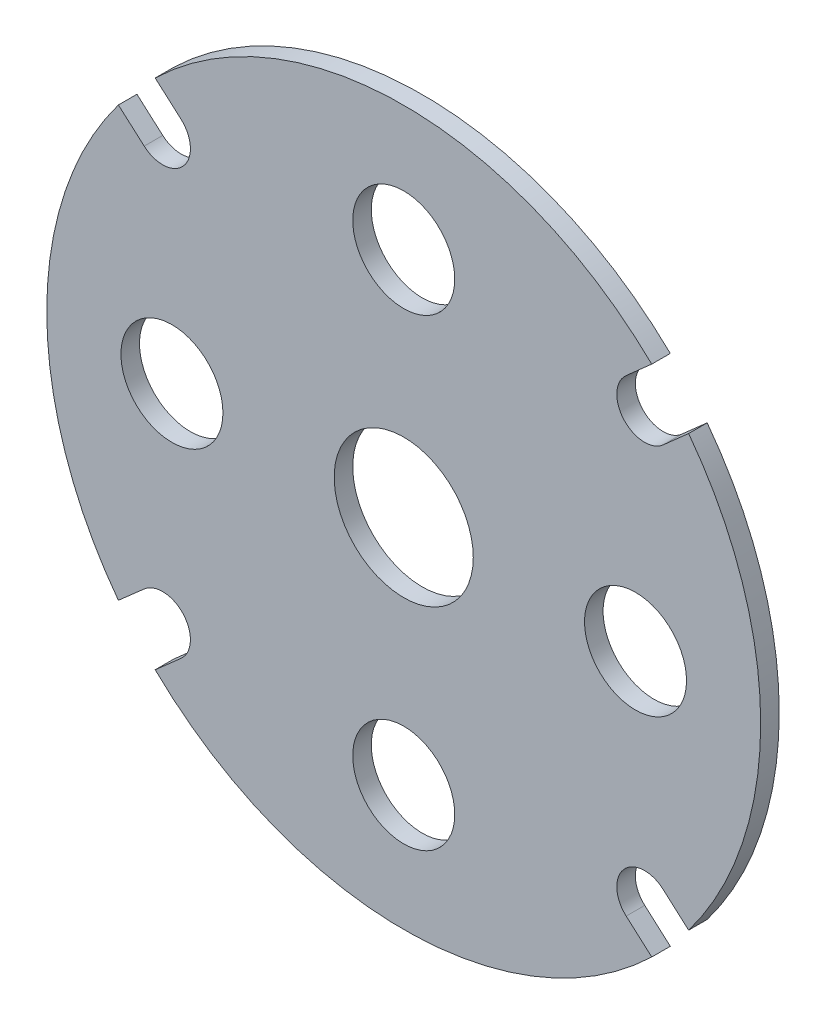
ISO-10303-21;
HEADER;
FILE_DESCRIPTION(('STEP AP214'),'2;1');
FILE_NAME('part.step','',(''),(''),'','','');
FILE_SCHEMA(('AUTOMOTIVE_DESIGN { 1 0 10303 214 1 1 1 1 }'));
ENDSEC;
DATA;
#1=APPLICATION_CONTEXT('core data for automotive mechanical design processes');
#2=APPLICATION_PROTOCOL_DEFINITION('international standard','automotive_design',2000,#1);
#3=PRODUCT_CONTEXT('',#1,'mechanical');
#4=PRODUCT('Part','Part','',(#3));
#5=PRODUCT_RELATED_PRODUCT_CATEGORY('part','',(#4));
#6=PRODUCT_DEFINITION_FORMATION('','',#4);
#7=PRODUCT_DEFINITION_CONTEXT('part definition',#1,'design');
#8=PRODUCT_DEFINITION('design','',#6,#7);
#9=PRODUCT_DEFINITION_SHAPE('','',#8);
#10=(LENGTH_UNIT() NAMED_UNIT(*) SI_UNIT(.MILLI.,.METRE.));
#11=(NAMED_UNIT(*) PLANE_ANGLE_UNIT() SI_UNIT($,.RADIAN.));
#12=(NAMED_UNIT(*) SI_UNIT($,.STERADIAN.) SOLID_ANGLE_UNIT());
#13=UNCERTAINTY_MEASURE_WITH_UNIT(LENGTH_MEASURE(1.E-05),#10,'distance_accuracy_value','');
#14=(GEOMETRIC_REPRESENTATION_CONTEXT(3) GLOBAL_UNCERTAINTY_ASSIGNED_CONTEXT((#13)) GLOBAL_UNIT_ASSIGNED_CONTEXT((#10,
#11,#12)) REPRESENTATION_CONTEXT('',''));
#15=CARTESIAN_POINT('',(0.,0.,0.));
#16=DIRECTION('',(0.,0.,1.));
#17=DIRECTION('',(1.,0.,0.));
#18=AXIS2_PLACEMENT_3D('',#15,#16,#17);
#19=CARTESIAN_POINT('',(0.,0.,2.));
#20=DIRECTION('',(0.,0.,1.));
#21=DIRECTION('',(1.,0.,0.));
#22=AXIS2_PLACEMENT_3D('',#19,#20,#21);
#23=PLANE('',#22);
#24=CARTESIAN_POINT('',(0.,-25.0000000000001,2.));
#25=DIRECTION('',(0.,0.,1.));
#26=DIRECTION('',(1.,0.,0.));
#27=AXIS2_PLACEMENT_3D('',#24,#25,#26);
#28=CIRCLE('',#27,5.50000000000006);
#29=CARTESIAN_POINT('',(5.50000000000006,-25.0000000000001,2.));
#30=VERTEX_POINT('',#29);
#31=EDGE_CURVE('E349',#30,#30,#28,.T.);
#32=ORIENTED_EDGE('',*,*,#31,.F.);
#33=EDGE_LOOP('',(#32));
#34=FACE_BOUND('',#33,.T.);
#35=CARTESIAN_POINT('',(-24.9999999999999,0.,2.));
#36=DIRECTION('',(0.,0.,1.));
#37=DIRECTION('',(1.,0.,0.));
#38=AXIS2_PLACEMENT_3D('',#35,#36,#37);
#39=CIRCLE('',#38,5.50000000000006);
#40=CARTESIAN_POINT('',(-19.4999999999999,0.,2.));
#41=VERTEX_POINT('',#40);
#42=EDGE_CURVE('E361',#41,#41,#39,.T.);
#43=ORIENTED_EDGE('',*,*,#42,.F.);
#44=EDGE_LOOP('',(#43));
#45=FACE_BOUND('',#44,.T.);
#46=CARTESIAN_POINT('',(0.,0.,2.));
#47=DIRECTION('',(0.,0.,1.));
#48=DIRECTION('',(1.,0.,0.));
#49=AXIS2_PLACEMENT_3D('',#46,#47,#48);
#50=CIRCLE('',#49,38.5000000000004);
#51=CARTESIAN_POINT('',(-26.8052389537677,-27.63565024803,2.));
#52=VERTEX_POINT('',#51);
#53=CARTESIAN_POINT('',(26.7507981884074,-27.6883512741934,2.));
#54=VERTEX_POINT('',#53);
#55=EDGE_CURVE('E210',#52,#54,#50,.T.);
#56=ORIENTED_EDGE('',*,*,#55,.T.);
#57=DIRECTION('',(-0.748753116344688,0.66284898035987,0.));
#58=VECTOR('',#57,1.);
#59=CARTESIAN_POINT('',(26.7507981884074,-27.6883512741934,2.));
#60=LINE('',#59,#58);
#61=CARTESIAN_POINT('',(23.9922151724542,-25.2462593490348,2.));
#62=VERTEX_POINT('',#61);
#63=EDGE_CURVE('E118',#54,#62,#60,.T.);
#64=ORIENTED_EDGE('',*,*,#63,.T.);
#65=CARTESIAN_POINT('',(25.9807621135339,-23.0000000000006,2.));
#66=DIRECTION('',(0.,0.,-1.));
#67=DIRECTION('',(1.,0.,0.));
#68=AXIS2_PLACEMENT_3D('',#65,#66,#67);
#69=CIRCLE('',#68,3.00000000000024);
#70=CARTESIAN_POINT('',(27.9693090546137,-20.7537406509663,2.));
#71=VERTEX_POINT('',#70);
#72=EDGE_CURVE('E249',#62,#71,#69,.T.);
#73=ORIENTED_EDGE('',*,*,#72,.T.);
#74=DIRECTION('',(0.74875311634469,-0.662848980359867,0.));
#75=VECTOR('',#74,1.);
#76=CARTESIAN_POINT('',(30.727892070567,-23.1958325761249,2.));
#77=LINE('',#76,#75);
#78=CARTESIAN_POINT('',(30.7278920705669,-23.1958325761249,2.));
#79=VERTEX_POINT('',#78);
#80=EDGE_CURVE('E268',#71,#79,#77,.T.);
#81=ORIENTED_EDGE('',*,*,#80,.T.);
#82=CARTESIAN_POINT('',(0.,0.,2.));
#83=DIRECTION('',(0.,0.,1.));
#84=DIRECTION('',(1.,0.,0.));
#85=AXIS2_PLACEMENT_3D('',#82,#83,#84);
#86=CIRCLE('',#85,38.5000000000004);
#87=CARTESIAN_POINT('',(30.727892070567,23.1958325761249,2.));
#88=VERTEX_POINT('',#87);
#89=EDGE_CURVE('E265',#79,#88,#86,.T.);
#90=ORIENTED_EDGE('',*,*,#89,.T.);
#91=DIRECTION('',(-0.74875311634469,-0.662848980359867,0.));
#92=VECTOR('',#91,1.);
#93=CARTESIAN_POINT('',(30.727892070567,23.1958325761249,2.));
#94=LINE('',#93,#92);
#95=CARTESIAN_POINT('',(27.9693090546136,20.7537406509665,2.));
#96=VERTEX_POINT('',#95);
#97=EDGE_CURVE('E267',#88,#96,#94,.T.);
#98=ORIENTED_EDGE('',*,*,#97,.T.);
#99=CARTESIAN_POINT('',(25.9807621135333,23.0000000000004,2.));
#100=DIRECTION('',(0.,0.,-1.));
#101=DIRECTION('',(1.,0.,0.));
#102=AXIS2_PLACEMENT_3D('',#99,#100,#101);
#103=CIRCLE('',#102,3.00000000000033);
#104=CARTESIAN_POINT('',(23.9922151724539,25.2462593490348,2.));
#105=VERTEX_POINT('',#104);
#106=EDGE_CURVE('E270',#96,#105,#103,.T.);
#107=ORIENTED_EDGE('',*,*,#106,.T.);
#108=DIRECTION('',(0.748753116344744,0.662848980359806,0.));
#109=VECTOR('',#108,1.);
#110=CARTESIAN_POINT('',(26.7507981884072,27.688351274193,2.));
#111=LINE('',#110,#109);
#112=CARTESIAN_POINT('',(26.7507981884073,27.6883512741932,2.));
#113=VERTEX_POINT('',#112);
#114=EDGE_CURVE('E276',#105,#113,#111,.T.);
#115=ORIENTED_EDGE('',*,*,#114,.T.);
#116=CARTESIAN_POINT('',(0.,0.,2.));
#117=DIRECTION('',(0.,0.,1.));
#118=DIRECTION('',(1.,0.,0.));
#119=AXIS2_PLACEMENT_3D('',#116,#117,#118);
#120=CIRCLE('',#119,38.5000000000001);
#121=CARTESIAN_POINT('',(-26.8052389537677,27.63565024803,2.));
#122=VERTEX_POINT('',#121);
#123=EDGE_CURVE('E278',#113,#122,#120,.T.);
#124=ORIENTED_EDGE('',*,*,#123,.T.);
#125=DIRECTION('',(0.750056198478579,-0.661374099223626,0.));
#126=VECTOR('',#125,1.);
#127=CARTESIAN_POINT('',(-26.8052389537677,27.63565024803,2.));
#128=LINE('',#127,#126);
#129=CARTESIAN_POINT('',(-24.0224474767815,25.1818791704066,2.));
#130=VERTEX_POINT('',#129);
#131=EDGE_CURVE('E280',#122,#130,#128,.T.);
#132=ORIENTED_EDGE('',*,*,#131,.T.);
#133=CARTESIAN_POINT('',(-26.0065697744526,22.9317105749707,2.));
#134=DIRECTION('',(0.,0.,-1.));
#135=DIRECTION('',(1.,0.,0.));
#136=AXIS2_PLACEMENT_3D('',#133,#134,#135);
#137=CIRCLE('',#136,3.00000000000024);
#138=CARTESIAN_POINT('',(-27.9906920721234,20.6815419795346,2.));
#139=VERTEX_POINT('',#138);
#140=EDGE_CURVE('E282',#130,#139,#137,.T.);
#141=ORIENTED_EDGE('',*,*,#140,.T.);
#142=DIRECTION('',(-0.75005619847863,0.661374099223568,0.));
#143=VECTOR('',#142,1.);
#144=CARTESIAN_POINT('',(-30.7734835491098,23.1353130571578,2.));
#145=LINE('',#144,#143);
#146=CARTESIAN_POINT('',(-30.7734835491098,23.1353130571578,2.));
#147=VERTEX_POINT('',#146);
#148=EDGE_CURVE('E284',#139,#147,#145,.T.);
#149=ORIENTED_EDGE('',*,*,#148,.T.);
#150=CARTESIAN_POINT('',(0.,0.,2.));
#151=DIRECTION('',(0.,0.,1.));
#152=DIRECTION('',(1.,0.,0.));
#153=AXIS2_PLACEMENT_3D('',#150,#151,#152);
#154=CIRCLE('',#153,38.5000000000004);
#155=CARTESIAN_POINT('',(-30.7734835491098,-23.1353130571578,2.));
#156=VERTEX_POINT('',#155);
#157=EDGE_CURVE('E161',#147,#156,#154,.T.);
#158=ORIENTED_EDGE('',*,*,#157,.T.);
#159=DIRECTION('',(0.75005619847863,0.661374099223568,0.));
#160=VECTOR('',#159,1.);
#161=CARTESIAN_POINT('',(-30.7734835491098,-23.1353130571578,2.));
#162=LINE('',#161,#160);
#163=CARTESIAN_POINT('',(-27.9906920721234,-20.6815419795346,2.));
#164=VERTEX_POINT('',#163);
#165=EDGE_CURVE('E155',#156,#164,#162,.T.);
#166=ORIENTED_EDGE('',*,*,#165,.T.);
#167=CARTESIAN_POINT('',(-26.0065697744526,-22.9317105749707,2.));
#168=DIRECTION('',(0.,0.,-1.));
#169=DIRECTION('',(1.,0.,0.));
#170=AXIS2_PLACEMENT_3D('',#167,#168,#169);
#171=CIRCLE('',#170,3.00000000000024);
#172=CARTESIAN_POINT('',(-24.0224474767815,-25.1818791704066,2.));
#173=VERTEX_POINT('',#172);
#174=EDGE_CURVE('E159',#164,#173,#171,.T.);
#175=ORIENTED_EDGE('',*,*,#174,.T.);
#176=DIRECTION('',(-0.750056198478579,-0.661374099223626,0.));
#177=VECTOR('',#176,1.);
#178=CARTESIAN_POINT('',(-26.8052389537677,-27.63565024803,2.));
#179=LINE('',#178,#177);
#180=EDGE_CURVE('E51',#173,#52,#179,.T.);
#181=ORIENTED_EDGE('',*,*,#180,.T.);
#182=EDGE_LOOP('',(#56,#64,#73,#81,#90,#98,#107,#115,#124,#132,#141,#149,#158,#166,#175,#181));
#183=FACE_BOUND('',#182,.T.);
#184=CARTESIAN_POINT('',(0.,0.,2.));
#185=DIRECTION('',(0.,0.,1.));
#186=DIRECTION('',(1.,0.,0.));
#187=AXIS2_PLACEMENT_3D('',#184,#185,#186);
#188=CIRCLE('',#187,7.49999999999984);
#189=CARTESIAN_POINT('',(7.49999999999984,0.,2.));
#190=VERTEX_POINT('',#189);
#191=EDGE_CURVE('E183',#190,#190,#188,.T.);
#192=ORIENTED_EDGE('',*,*,#191,.F.);
#193=EDGE_LOOP('',(#192));
#194=FACE_BOUND('',#193,.T.);
#195=CARTESIAN_POINT('',(0.,24.9999999999999,2.));
#196=DIRECTION('',(0.,0.,1.));
#197=DIRECTION('',(1.,0.,0.));
#198=AXIS2_PLACEMENT_3D('',#195,#196,#197);
#199=CIRCLE('',#198,5.50000000000006);
#200=CARTESIAN_POINT('',(5.50000000000006,24.9999999999999,2.));
#201=VERTEX_POINT('',#200);
#202=EDGE_CURVE('E355',#201,#201,#199,.T.);
#203=ORIENTED_EDGE('',*,*,#202,.F.);
#204=EDGE_LOOP('',(#203));
#205=FACE_BOUND('',#204,.T.);
#206=CARTESIAN_POINT('',(24.9999999999999,0.,2.));
#207=DIRECTION('',(0.,0.,1.));
#208=DIRECTION('',(1.,0.,0.));
#209=AXIS2_PLACEMENT_3D('',#206,#207,#208);
#210=CIRCLE('',#209,5.50000000000006);
#211=CARTESIAN_POINT('',(30.5,0.,2.));
#212=VERTEX_POINT('',#211);
#213=EDGE_CURVE('E340',#212,#212,#210,.T.);
#214=ORIENTED_EDGE('',*,*,#213,.F.);
#215=EDGE_LOOP('',(#214));
#216=FACE_BOUND('',#215,.T.);
#217=ADVANCED_FACE('F34',(#34,#45,#183,#194,#205,#216),#23,.T.);
#218=CARTESIAN_POINT('',(0.,0.,0.));
#219=DIRECTION('',(0.,0.,1.));
#220=DIRECTION('',(1.,0.,0.));
#221=AXIS2_PLACEMENT_3D('',#218,#219,#220);
#222=PLANE('',#221);
#223=CARTESIAN_POINT('',(0.,-25.0000000000001,0.));
#224=DIRECTION('',(0.,0.,1.));
#225=DIRECTION('',(1.,0.,0.));
#226=AXIS2_PLACEMENT_3D('',#223,#224,#225);
#227=CIRCLE('',#226,5.50000000000006);
#228=CARTESIAN_POINT('',(5.50000000000006,-25.0000000000001,0.));
#229=VERTEX_POINT('',#228);
#230=EDGE_CURVE('E346',#229,#229,#227,.T.);
#231=ORIENTED_EDGE('',*,*,#230,.T.);
#232=EDGE_LOOP('',(#231));
#233=FACE_BOUND('',#232,.T.);
#234=CARTESIAN_POINT('',(-24.9999999999999,0.,0.));
#235=DIRECTION('',(0.,0.,1.));
#236=DIRECTION('',(1.,0.,0.));
#237=AXIS2_PLACEMENT_3D('',#234,#235,#236);
#238=CIRCLE('',#237,5.50000000000006);
#239=CARTESIAN_POINT('',(-19.4999999999999,0.,0.));
#240=VERTEX_POINT('',#239);
#241=EDGE_CURVE('E358',#240,#240,#238,.T.);
#242=ORIENTED_EDGE('',*,*,#241,.T.);
#243=EDGE_LOOP('',(#242));
#244=FACE_BOUND('',#243,.T.);
#245=CARTESIAN_POINT('',(0.,0.,0.));
#246=DIRECTION('',(0.,0.,1.));
#247=DIRECTION('',(1.,0.,0.));
#248=AXIS2_PLACEMENT_3D('',#245,#246,#247);
#249=CIRCLE('',#248,38.5000000000004);
#250=CARTESIAN_POINT('',(-26.8052389537677,-27.63565024803,0.));
#251=VERTEX_POINT('',#250);
#252=CARTESIAN_POINT('',(26.7507981884074,-27.6883512741934,0.));
#253=VERTEX_POINT('',#252);
#254=EDGE_CURVE('E179',#251,#253,#249,.T.);
#255=ORIENTED_EDGE('',*,*,#254,.F.);
#256=DIRECTION('',(-0.750056198478579,-0.661374099223626,0.));
#257=VECTOR('',#256,1.);
#258=CARTESIAN_POINT('',(-26.8052389537677,-27.63565024803,0.));
#259=LINE('',#258,#257);
#260=CARTESIAN_POINT('',(-24.0224474767815,-25.1818791704066,0.));
#261=VERTEX_POINT('',#260);
#262=EDGE_CURVE('E110',#261,#251,#259,.T.);
#263=ORIENTED_EDGE('',*,*,#262,.F.);
#264=CARTESIAN_POINT('',(-26.0065697744526,-22.9317105749707,0.));
#265=DIRECTION('',(0.,0.,-1.));
#266=DIRECTION('',(1.,0.,0.));
#267=AXIS2_PLACEMENT_3D('',#264,#265,#266);
#268=CIRCLE('',#267,3.00000000000024);
#269=CARTESIAN_POINT('',(-27.9906920721234,-20.6815419795346,0.));
#270=VERTEX_POINT('',#269);
#271=EDGE_CURVE('E104',#270,#261,#268,.T.);
#272=ORIENTED_EDGE('',*,*,#271,.F.);
#273=DIRECTION('',(0.75005619847863,0.661374099223568,0.));
#274=VECTOR('',#273,1.);
#275=CARTESIAN_POINT('',(-30.7734835491098,-23.1353130571578,0.));
#276=LINE('',#275,#274);
#277=CARTESIAN_POINT('',(-30.7734835491098,-23.1353130571578,0.));
#278=VERTEX_POINT('',#277);
#279=EDGE_CURVE('E169',#278,#270,#276,.T.);
#280=ORIENTED_EDGE('',*,*,#279,.F.);
#281=CARTESIAN_POINT('',(0.,0.,0.));
#282=DIRECTION('',(0.,0.,1.));
#283=DIRECTION('',(1.,0.,0.));
#284=AXIS2_PLACEMENT_3D('',#281,#282,#283);
#285=CIRCLE('',#284,38.5000000000004);
#286=CARTESIAN_POINT('',(-30.7734835491098,23.1353130571578,0.));
#287=VERTEX_POINT('',#286);
#288=EDGE_CURVE('E205',#287,#278,#285,.T.);
#289=ORIENTED_EDGE('',*,*,#288,.F.);
#290=DIRECTION('',(-0.75005619847863,0.661374099223568,0.));
#291=VECTOR('',#290,1.);
#292=CARTESIAN_POINT('',(-30.7734835491098,23.1353130571578,0.));
#293=LINE('',#292,#291);
#294=CARTESIAN_POINT('',(-27.9906920721234,20.6815419795346,0.));
#295=VERTEX_POINT('',#294);
#296=EDGE_CURVE('E203',#295,#287,#293,.T.);
#297=ORIENTED_EDGE('',*,*,#296,.F.);
#298=CARTESIAN_POINT('',(-26.0065697744526,22.9317105749707,0.));
#299=DIRECTION('',(0.,0.,-1.));
#300=DIRECTION('',(1.,0.,0.));
#301=AXIS2_PLACEMENT_3D('',#298,#299,#300);
#302=CIRCLE('',#301,3.00000000000024);
#303=CARTESIAN_POINT('',(-24.0224474767815,25.1818791704066,0.));
#304=VERTEX_POINT('',#303);
#305=EDGE_CURVE('E201',#304,#295,#302,.T.);
#306=ORIENTED_EDGE('',*,*,#305,.F.);
#307=DIRECTION('',(0.750056198478579,-0.661374099223626,0.));
#308=VECTOR('',#307,1.);
#309=CARTESIAN_POINT('',(-26.8052389537677,27.63565024803,0.));
#310=LINE('',#309,#308);
#311=CARTESIAN_POINT('',(-26.8052389537677,27.63565024803,0.));
#312=VERTEX_POINT('',#311);
#313=EDGE_CURVE('E199',#312,#304,#310,.T.);
#314=ORIENTED_EDGE('',*,*,#313,.F.);
#315=CARTESIAN_POINT('',(0.,0.,0.));
#316=DIRECTION('',(0.,0.,1.));
#317=DIRECTION('',(1.,0.,0.));
#318=AXIS2_PLACEMENT_3D('',#315,#316,#317);
#319=CIRCLE('',#318,38.5000000000001);
#320=CARTESIAN_POINT('',(26.7507981884073,27.6883512741932,0.));
#321=VERTEX_POINT('',#320);
#322=EDGE_CURVE('E197',#321,#312,#319,.T.);
#323=ORIENTED_EDGE('',*,*,#322,.F.);
#324=DIRECTION('',(0.748753116344744,0.662848980359806,0.));
#325=VECTOR('',#324,1.);
#326=CARTESIAN_POINT('',(26.7507981884072,27.688351274193,0.));
#327=LINE('',#326,#325);
#328=CARTESIAN_POINT('',(23.9922151724539,25.2462593490348,0.));
#329=VERTEX_POINT('',#328);
#330=EDGE_CURVE('E195',#329,#321,#327,.T.);
#331=ORIENTED_EDGE('',*,*,#330,.F.);
#332=CARTESIAN_POINT('',(25.9807621135333,23.0000000000004,0.));
#333=DIRECTION('',(0.,0.,-1.));
#334=DIRECTION('',(1.,0.,0.));
#335=AXIS2_PLACEMENT_3D('',#332,#333,#334);
#336=CIRCLE('',#335,3.00000000000033);
#337=CARTESIAN_POINT('',(27.9693090546136,20.7537406509665,0.));
#338=VERTEX_POINT('',#337);
#339=EDGE_CURVE('E193',#338,#329,#336,.T.);
#340=ORIENTED_EDGE('',*,*,#339,.F.);
#341=DIRECTION('',(-0.74875311634469,-0.662848980359867,0.));
#342=VECTOR('',#341,1.);
#343=CARTESIAN_POINT('',(30.727892070567,23.1958325761249,0.));
#344=LINE('',#343,#342);
#345=CARTESIAN_POINT('',(30.727892070567,23.1958325761249,0.));
#346=VERTEX_POINT('',#345);
#347=EDGE_CURVE('E191',#346,#338,#344,.T.);
#348=ORIENTED_EDGE('',*,*,#347,.F.);
#349=CARTESIAN_POINT('',(0.,0.,0.));
#350=DIRECTION('',(0.,0.,1.));
#351=DIRECTION('',(1.,0.,0.));
#352=AXIS2_PLACEMENT_3D('',#349,#350,#351);
#353=CIRCLE('',#352,38.5000000000004);
#354=CARTESIAN_POINT('',(30.7278920705669,-23.1958325761249,0.));
#355=VERTEX_POINT('',#354);
#356=EDGE_CURVE('E189',#355,#346,#353,.T.);
#357=ORIENTED_EDGE('',*,*,#356,.F.);
#358=DIRECTION('',(0.74875311634469,-0.662848980359867,0.));
#359=VECTOR('',#358,1.);
#360=CARTESIAN_POINT('',(30.727892070567,-23.1958325761249,0.));
#361=LINE('',#360,#359);
#362=CARTESIAN_POINT('',(27.9693090546137,-20.7537406509663,0.));
#363=VERTEX_POINT('',#362);
#364=EDGE_CURVE('E187',#363,#355,#361,.T.);
#365=ORIENTED_EDGE('',*,*,#364,.F.);
#366=CARTESIAN_POINT('',(25.9807621135339,-23.0000000000006,0.));
#367=DIRECTION('',(0.,0.,-1.));
#368=DIRECTION('',(1.,0.,0.));
#369=AXIS2_PLACEMENT_3D('',#366,#367,#368);
#370=CIRCLE('',#369,3.00000000000024);
#371=CARTESIAN_POINT('',(23.9922151724542,-25.2462593490348,0.));
#372=VERTEX_POINT('',#371);
#373=EDGE_CURVE('E185',#372,#363,#370,.T.);
#374=ORIENTED_EDGE('',*,*,#373,.F.);
#375=DIRECTION('',(-0.748753116344688,0.66284898035987,0.));
#376=VECTOR('',#375,1.);
#377=CARTESIAN_POINT('',(26.7507981884074,-27.6883512741934,0.));
#378=LINE('',#377,#376);
#379=EDGE_CURVE('E182',#253,#372,#378,.T.);
#380=ORIENTED_EDGE('',*,*,#379,.F.);
#381=EDGE_LOOP('',(#255,#263,#272,#280,#289,#297,#306,#314,#323,#331,#340,#348,#357,#365,#374,#380));
#382=FACE_BOUND('',#381,.T.);
#383=CARTESIAN_POINT('',(0.,0.,0.));
#384=DIRECTION('',(0.,0.,1.));
#385=DIRECTION('',(1.,0.,0.));
#386=AXIS2_PLACEMENT_3D('',#383,#384,#385);
#387=CIRCLE('',#386,7.49999999999984);
#388=CARTESIAN_POINT('',(7.49999999999984,0.,0.));
#389=VERTEX_POINT('',#388);
#390=EDGE_CURVE('E364',#389,#389,#387,.T.);
#391=ORIENTED_EDGE('',*,*,#390,.T.);
#392=EDGE_LOOP('',(#391));
#393=FACE_BOUND('',#392,.T.);
#394=CARTESIAN_POINT('',(0.,24.9999999999999,0.));
#395=DIRECTION('',(0.,0.,1.));
#396=DIRECTION('',(1.,0.,0.));
#397=AXIS2_PLACEMENT_3D('',#394,#395,#396);
#398=CIRCLE('',#397,5.50000000000006);
#399=CARTESIAN_POINT('',(5.50000000000006,24.9999999999999,0.));
#400=VERTEX_POINT('',#399);
#401=EDGE_CURVE('E352',#400,#400,#398,.T.);
#402=ORIENTED_EDGE('',*,*,#401,.T.);
#403=EDGE_LOOP('',(#402));
#404=FACE_BOUND('',#403,.T.);
#405=CARTESIAN_POINT('',(24.9999999999999,0.,0.));
#406=DIRECTION('',(0.,0.,1.));
#407=DIRECTION('',(1.,0.,0.));
#408=AXIS2_PLACEMENT_3D('',#405,#406,#407);
#409=CIRCLE('',#408,5.50000000000006);
#410=CARTESIAN_POINT('',(30.5,0.,0.));
#411=VERTEX_POINT('',#410);
#412=EDGE_CURVE('E343',#411,#411,#409,.T.);
#413=ORIENTED_EDGE('',*,*,#412,.T.);
#414=EDGE_LOOP('',(#413));
#415=FACE_BOUND('',#414,.T.);
#416=ADVANCED_FACE('F253',(#233,#244,#382,#393,#404,#415),#222,.F.);
#417=CARTESIAN_POINT('',(0.,0.,2.));
#418=DIRECTION('',(0.,0.,-1.));
#419=DIRECTION('',(-1.,0.,0.));
#420=AXIS2_PLACEMENT_3D('',#417,#418,#419);
#421=CYLINDRICAL_SURFACE('',#420,38.5000000000004);
#422=ORIENTED_EDGE('',*,*,#254,.T.);
#423=DIRECTION('',(0.,0.,-1.));
#424=VECTOR('',#423,1.);
#425=CARTESIAN_POINT('',(26.7507981884074,-27.6883512741934,2.));
#426=LINE('',#425,#424);
#427=EDGE_CURVE('E11',#54,#253,#426,.T.);
#428=ORIENTED_EDGE('',*,*,#427,.F.);
#429=ORIENTED_EDGE('',*,*,#55,.F.);
#430=DIRECTION('',(0.,0.,-1.));
#431=VECTOR('',#430,1.);
#432=CARTESIAN_POINT('',(-26.8052389537677,-27.63565024803,2.));
#433=LINE('',#432,#431);
#434=EDGE_CURVE('E175',#52,#251,#433,.T.);
#435=ORIENTED_EDGE('',*,*,#434,.T.);
#436=EDGE_LOOP('',(#422,#428,#429,#435));
#437=FACE_BOUND('',#436,.T.);
#438=ADVANCED_FACE('F36',(#437),#421,.T.);
#439=CARTESIAN_POINT('',(26.7507981884074,-27.6883512741934,2.));
#440=DIRECTION('',(-0.66284898035987,-0.748753116344688,0.));
#441=DIRECTION('',(0.748753116344688,-0.66284898035987,0.));
#442=AXIS2_PLACEMENT_3D('',#439,#440,#441);
#443=PLANE('',#442);
#444=ORIENTED_EDGE('',*,*,#379,.T.);
#445=DIRECTION('',(0.,0.,-1.));
#446=VECTOR('',#445,1.);
#447=CARTESIAN_POINT('',(23.9922151724542,-25.2462593490348,2.));
#448=LINE('',#447,#446);
#449=EDGE_CURVE('E43',#62,#372,#448,.T.);
#450=ORIENTED_EDGE('',*,*,#449,.F.);
#451=ORIENTED_EDGE('',*,*,#63,.F.);
#452=ORIENTED_EDGE('',*,*,#427,.T.);
#453=EDGE_LOOP('',(#444,#450,#451,#452));
#454=FACE_BOUND('',#453,.T.);
#455=ADVANCED_FACE('F522',(#454),#443,.F.);
#456=CARTESIAN_POINT('',(25.9807621135339,-23.0000000000006,2.));
#457=DIRECTION('',(0.,0.,-1.));
#458=DIRECTION('',(-1.,0.,0.));
#459=AXIS2_PLACEMENT_3D('',#456,#457,#458);
#460=CYLINDRICAL_SURFACE('',#459,3.00000000000024);
#461=ORIENTED_EDGE('',*,*,#373,.T.);
#462=DIRECTION('',(0.,0.,-1.));
#463=VECTOR('',#462,1.);
#464=CARTESIAN_POINT('',(27.9693090546137,-20.7537406509663,2.));
#465=LINE('',#464,#463);
#466=EDGE_CURVE('E241',#71,#363,#465,.T.);
#467=ORIENTED_EDGE('',*,*,#466,.F.);
#468=ORIENTED_EDGE('',*,*,#72,.F.);
#469=ORIENTED_EDGE('',*,*,#449,.T.);
#470=EDGE_LOOP('',(#461,#467,#468,#469));
#471=FACE_BOUND('',#470,.T.);
#472=ADVANCED_FACE('F247',(#471),#460,.F.);
#473=CARTESIAN_POINT('',(30.727892070567,-23.1958325761249,2.));
#474=DIRECTION('',(0.662848980359867,0.74875311634469,0.));
#475=DIRECTION('',(-0.74875311634469,0.662848980359867,0.));
#476=AXIS2_PLACEMENT_3D('',#473,#474,#475);
#477=PLANE('',#476);
#478=ORIENTED_EDGE('',*,*,#364,.T.);
#479=DIRECTION('',(0.,0.,-1.));
#480=VECTOR('',#479,1.);
#481=CARTESIAN_POINT('',(30.7278920705669,-23.1958325761249,2.));
#482=LINE('',#481,#480);
#483=EDGE_CURVE('E238',#79,#355,#482,.T.);
#484=ORIENTED_EDGE('',*,*,#483,.F.);
#485=ORIENTED_EDGE('',*,*,#80,.F.);
#486=ORIENTED_EDGE('',*,*,#466,.T.);
#487=EDGE_LOOP('',(#478,#484,#485,#486));
#488=FACE_BOUND('',#487,.T.);
#489=ADVANCED_FACE('F259',(#488),#477,.F.);
#490=CARTESIAN_POINT('',(0.,0.,2.));
#491=DIRECTION('',(0.,0.,-1.));
#492=DIRECTION('',(-1.,0.,0.));
#493=AXIS2_PLACEMENT_3D('',#490,#491,#492);
#494=CYLINDRICAL_SURFACE('',#493,38.5000000000004);
#495=ORIENTED_EDGE('',*,*,#356,.T.);
#496=DIRECTION('',(0.,0.,-1.));
#497=VECTOR('',#496,1.);
#498=CARTESIAN_POINT('',(30.727892070567,23.1958325761249,2.));
#499=LINE('',#498,#497);
#500=EDGE_CURVE('E235',#88,#346,#499,.T.);
#501=ORIENTED_EDGE('',*,*,#500,.F.);
#502=ORIENTED_EDGE('',*,*,#89,.F.);
#503=ORIENTED_EDGE('',*,*,#483,.T.);
#504=EDGE_LOOP('',(#495,#501,#502,#503));
#505=FACE_BOUND('',#504,.T.);
#506=ADVANCED_FACE('F263',(#505),#494,.T.);
#507=CARTESIAN_POINT('',(30.727892070567,23.1958325761249,2.));
#508=DIRECTION('',(0.662848980359867,-0.74875311634469,0.));
#509=DIRECTION('',(0.74875311634469,0.662848980359867,0.));
#510=AXIS2_PLACEMENT_3D('',#507,#508,#509);
#511=PLANE('',#510);
#512=ORIENTED_EDGE('',*,*,#347,.T.);
#513=DIRECTION('',(0.,0.,-1.));
#514=VECTOR('',#513,1.);
#515=CARTESIAN_POINT('',(27.9693090546136,20.7537406509665,2.));
#516=LINE('',#515,#514);
#517=EDGE_CURVE('E232',#96,#338,#516,.T.);
#518=ORIENTED_EDGE('',*,*,#517,.F.);
#519=ORIENTED_EDGE('',*,*,#97,.F.);
#520=ORIENTED_EDGE('',*,*,#500,.T.);
#521=EDGE_LOOP('',(#512,#518,#519,#520));
#522=FACE_BOUND('',#521,.T.);
#523=ADVANCED_FACE('F487',(#522),#511,.F.);
#524=CARTESIAN_POINT('',(25.9807621135333,23.0000000000004,2.));
#525=DIRECTION('',(0.,0.,-1.));
#526=DIRECTION('',(-1.,0.,0.));
#527=AXIS2_PLACEMENT_3D('',#524,#525,#526);
#528=CYLINDRICAL_SURFACE('',#527,3.00000000000033);
#529=ORIENTED_EDGE('',*,*,#339,.T.);
#530=DIRECTION('',(0.,0.,-1.));
#531=VECTOR('',#530,1.);
#532=CARTESIAN_POINT('',(23.9922151724539,25.2462593490348,2.));
#533=LINE('',#532,#531);
#534=EDGE_CURVE('E229',#105,#329,#533,.T.);
#535=ORIENTED_EDGE('',*,*,#534,.F.);
#536=ORIENTED_EDGE('',*,*,#106,.F.);
#537=ORIENTED_EDGE('',*,*,#517,.T.);
#538=EDGE_LOOP('',(#529,#535,#536,#537));
#539=FACE_BOUND('',#538,.T.);
#540=ADVANCED_FACE('F477',(#539),#528,.F.);
#541=CARTESIAN_POINT('',(26.7507981884072,27.688351274193,2.));
#542=DIRECTION('',(-0.662848980359806,0.748753116344744,0.));
#543=DIRECTION('',(-0.748753116344744,-0.662848980359806,0.));
#544=AXIS2_PLACEMENT_3D('',#541,#542,#543);
#545=PLANE('',#544);
#546=ORIENTED_EDGE('',*,*,#330,.T.);
#547=DIRECTION('',(0.,0.,-1.));
#548=VECTOR('',#547,1.);
#549=CARTESIAN_POINT('',(26.7507981884073,27.6883512741932,2.));
#550=LINE('',#549,#548);
#551=EDGE_CURVE('E226',#113,#321,#550,.T.);
#552=ORIENTED_EDGE('',*,*,#551,.F.);
#553=ORIENTED_EDGE('',*,*,#114,.F.);
#554=ORIENTED_EDGE('',*,*,#534,.T.);
#555=EDGE_LOOP('',(#546,#552,#553,#554));
#556=FACE_BOUND('',#555,.T.);
#557=ADVANCED_FACE('F467',(#556),#545,.F.);
#558=CARTESIAN_POINT('',(0.,0.,2.));
#559=DIRECTION('',(0.,0.,-1.));
#560=DIRECTION('',(-1.,0.,0.));
#561=AXIS2_PLACEMENT_3D('',#558,#559,#560);
#562=CYLINDRICAL_SURFACE('',#561,38.5000000000001);
#563=ORIENTED_EDGE('',*,*,#322,.T.);
#564=DIRECTION('',(0.,0.,-1.));
#565=VECTOR('',#564,1.);
#566=CARTESIAN_POINT('',(-26.8052389537677,27.63565024803,2.));
#567=LINE('',#566,#565);
#568=EDGE_CURVE('E223',#122,#312,#567,.T.);
#569=ORIENTED_EDGE('',*,*,#568,.F.);
#570=ORIENTED_EDGE('',*,*,#123,.F.);
#571=ORIENTED_EDGE('',*,*,#551,.T.);
#572=EDGE_LOOP('',(#563,#569,#570,#571));
#573=FACE_BOUND('',#572,.T.);
#574=ADVANCED_FACE('F457',(#573),#562,.T.);
#575=CARTESIAN_POINT('',(-26.8052389537677,27.63565024803,2.));
#576=DIRECTION('',(0.661374099223626,0.750056198478579,0.));
#577=DIRECTION('',(-0.750056198478579,0.661374099223626,0.));
#578=AXIS2_PLACEMENT_3D('',#575,#576,#577);
#579=PLANE('',#578);
#580=ORIENTED_EDGE('',*,*,#313,.T.);
#581=DIRECTION('',(0.,0.,-1.));
#582=VECTOR('',#581,1.);
#583=CARTESIAN_POINT('',(-24.0224474767815,25.1818791704066,2.));
#584=LINE('',#583,#582);
#585=EDGE_CURVE('E220',#130,#304,#584,.T.);
#586=ORIENTED_EDGE('',*,*,#585,.F.);
#587=ORIENTED_EDGE('',*,*,#131,.F.);
#588=ORIENTED_EDGE('',*,*,#568,.T.);
#589=EDGE_LOOP('',(#580,#586,#587,#588));
#590=FACE_BOUND('',#589,.T.);
#591=ADVANCED_FACE('F447',(#590),#579,.F.);
#592=CARTESIAN_POINT('',(-26.0065697744526,22.9317105749707,2.));
#593=DIRECTION('',(0.,0.,-1.));
#594=DIRECTION('',(-1.,0.,0.));
#595=AXIS2_PLACEMENT_3D('',#592,#593,#594);
#596=CYLINDRICAL_SURFACE('',#595,3.00000000000024);
#597=ORIENTED_EDGE('',*,*,#305,.T.);
#598=DIRECTION('',(0.,0.,-1.));
#599=VECTOR('',#598,1.);
#600=CARTESIAN_POINT('',(-27.9906920721234,20.6815419795346,2.));
#601=LINE('',#600,#599);
#602=EDGE_CURVE('E217',#139,#295,#601,.T.);
#603=ORIENTED_EDGE('',*,*,#602,.F.);
#604=ORIENTED_EDGE('',*,*,#140,.F.);
#605=ORIENTED_EDGE('',*,*,#585,.T.);
#606=EDGE_LOOP('',(#597,#603,#604,#605));
#607=FACE_BOUND('',#606,.T.);
#608=ADVANCED_FACE('F438',(#607),#596,.F.);
#609=CARTESIAN_POINT('',(-30.7734835491098,23.1353130571578,2.));
#610=DIRECTION('',(-0.661374099223568,-0.75005619847863,0.));
#611=DIRECTION('',(0.75005619847863,-0.661374099223568,0.));
#612=AXIS2_PLACEMENT_3D('',#609,#610,#611);
#613=PLANE('',#612);
#614=ORIENTED_EDGE('',*,*,#296,.T.);
#615=DIRECTION('',(0.,0.,-1.));
#616=VECTOR('',#615,1.);
#617=CARTESIAN_POINT('',(-30.7734835491098,23.1353130571578,2.));
#618=LINE('',#617,#616);
#619=EDGE_CURVE('E214',#147,#287,#618,.T.);
#620=ORIENTED_EDGE('',*,*,#619,.F.);
#621=ORIENTED_EDGE('',*,*,#148,.F.);
#622=ORIENTED_EDGE('',*,*,#602,.T.);
#623=EDGE_LOOP('',(#614,#620,#621,#622));
#624=FACE_BOUND('',#623,.T.);
#625=ADVANCED_FACE('F290',(#624),#613,.F.);
#626=CARTESIAN_POINT('',(0.,0.,2.));
#627=DIRECTION('',(0.,0.,-1.));
#628=DIRECTION('',(-1.,0.,0.));
#629=AXIS2_PLACEMENT_3D('',#626,#627,#628);
#630=CYLINDRICAL_SURFACE('',#629,38.5000000000004);
#631=ORIENTED_EDGE('',*,*,#288,.T.);
#632=DIRECTION('',(0.,0.,-1.));
#633=VECTOR('',#632,1.);
#634=CARTESIAN_POINT('',(-30.7734835491098,-23.1353130571578,2.));
#635=LINE('',#634,#633);
#636=EDGE_CURVE('E170',#156,#278,#635,.T.);
#637=ORIENTED_EDGE('',*,*,#636,.F.);
#638=ORIENTED_EDGE('',*,*,#157,.F.);
#639=ORIENTED_EDGE('',*,*,#619,.T.);
#640=EDGE_LOOP('',(#631,#637,#638,#639));
#641=FACE_BOUND('',#640,.T.);
#642=ADVANCED_FACE('F294',(#641),#630,.T.);
#643=CARTESIAN_POINT('',(-30.7734835491098,-23.1353130571578,2.));
#644=DIRECTION('',(-0.661374099223568,0.75005619847863,0.));
#645=DIRECTION('',(-0.75005619847863,-0.661374099223568,0.));
#646=AXIS2_PLACEMENT_3D('',#643,#644,#645);
#647=PLANE('',#646);
#648=ORIENTED_EDGE('',*,*,#279,.T.);
#649=DIRECTION('',(0.,0.,-1.));
#650=VECTOR('',#649,1.);
#651=CARTESIAN_POINT('',(-27.9906920721234,-20.6815419795346,2.));
#652=LINE('',#651,#650);
#653=EDGE_CURVE('E166',#164,#270,#652,.T.);
#654=ORIENTED_EDGE('',*,*,#653,.F.);
#655=ORIENTED_EDGE('',*,*,#165,.F.);
#656=ORIENTED_EDGE('',*,*,#636,.T.);
#657=EDGE_LOOP('',(#648,#654,#655,#656));
#658=FACE_BOUND('',#657,.T.);
#659=ADVANCED_FACE('F167',(#658),#647,.F.);
#660=CARTESIAN_POINT('',(-26.0065697744526,-22.9317105749707,2.));
#661=DIRECTION('',(0.,0.,-1.));
#662=DIRECTION('',(-1.,0.,0.));
#663=AXIS2_PLACEMENT_3D('',#660,#661,#662);
#664=CYLINDRICAL_SURFACE('',#663,3.00000000000024);
#665=ORIENTED_EDGE('',*,*,#271,.T.);
#666=DIRECTION('',(0.,0.,-1.));
#667=VECTOR('',#666,1.);
#668=CARTESIAN_POINT('',(-24.0224474767815,-25.1818791704066,2.));
#669=LINE('',#668,#667);
#670=EDGE_CURVE('E171',#173,#261,#669,.T.);
#671=ORIENTED_EDGE('',*,*,#670,.F.);
#672=ORIENTED_EDGE('',*,*,#174,.F.);
#673=ORIENTED_EDGE('',*,*,#653,.T.);
#674=EDGE_LOOP('',(#665,#671,#672,#673));
#675=FACE_BOUND('',#674,.T.);
#676=ADVANCED_FACE('F173',(#675),#664,.F.);
#677=CARTESIAN_POINT('',(-26.8052389537677,-27.63565024803,2.));
#678=DIRECTION('',(0.661374099223626,-0.750056198478579,0.));
#679=DIRECTION('',(0.750056198478579,0.661374099223626,0.));
#680=AXIS2_PLACEMENT_3D('',#677,#678,#679);
#681=PLANE('',#680);
#682=ORIENTED_EDGE('',*,*,#262,.T.);
#683=ORIENTED_EDGE('',*,*,#434,.F.);
#684=ORIENTED_EDGE('',*,*,#180,.F.);
#685=ORIENTED_EDGE('',*,*,#670,.T.);
#686=EDGE_LOOP('',(#682,#683,#684,#685));
#687=FACE_BOUND('',#686,.T.);
#688=ADVANCED_FACE('F298',(#687),#681,.F.);
#689=CARTESIAN_POINT('',(0.,0.,2.));
#690=DIRECTION('',(0.,0.,-1.));
#691=DIRECTION('',(-1.,0.,0.));
#692=AXIS2_PLACEMENT_3D('',#689,#690,#691);
#693=CYLINDRICAL_SURFACE('',#692,7.49999999999984);
#694=ORIENTED_EDGE('',*,*,#191,.T.);
#695=EDGE_LOOP('',(#694));
#696=FACE_BOUND('',#695,.T.);
#697=ORIENTED_EDGE('',*,*,#390,.F.);
#698=EDGE_LOOP('',(#697));
#699=FACE_BOUND('',#698,.T.);
#700=ADVANCED_FACE('F300',(#696,#699),#693,.F.);
#701=CARTESIAN_POINT('',(-24.9999999999999,0.,2.));
#702=DIRECTION('',(0.,0.,-1.));
#703=DIRECTION('',(-1.,0.,0.));
#704=AXIS2_PLACEMENT_3D('',#701,#702,#703);
#705=CYLINDRICAL_SURFACE('',#704,5.50000000000006);
#706=ORIENTED_EDGE('',*,*,#42,.T.);
#707=EDGE_LOOP('',(#706));
#708=FACE_BOUND('',#707,.T.);
#709=ORIENTED_EDGE('',*,*,#241,.F.);
#710=EDGE_LOOP('',(#709));
#711=FACE_BOUND('',#710,.T.);
#712=ADVANCED_FACE('F306',(#708,#711),#705,.F.);
#713=CARTESIAN_POINT('',(0.,24.9999999999999,2.));
#714=DIRECTION('',(0.,0.,-1.));
#715=DIRECTION('',(-1.,0.,0.));
#716=AXIS2_PLACEMENT_3D('',#713,#714,#715);
#717=CYLINDRICAL_SURFACE('',#716,5.50000000000006);
#718=ORIENTED_EDGE('',*,*,#202,.T.);
#719=EDGE_LOOP('',(#718));
#720=FACE_BOUND('',#719,.T.);
#721=ORIENTED_EDGE('',*,*,#401,.F.);
#722=EDGE_LOOP('',(#721));
#723=FACE_BOUND('',#722,.T.);
#724=ADVANCED_FACE('F323',(#720,#723),#717,.F.);
#725=CARTESIAN_POINT('',(0.,-25.0000000000001,2.));
#726=DIRECTION('',(0.,0.,-1.));
#727=DIRECTION('',(-1.,0.,0.));
#728=AXIS2_PLACEMENT_3D('',#725,#726,#727);
#729=CYLINDRICAL_SURFACE('',#728,5.50000000000006);
#730=ORIENTED_EDGE('',*,*,#31,.T.);
#731=EDGE_LOOP('',(#730));
#732=FACE_BOUND('',#731,.T.);
#733=ORIENTED_EDGE('',*,*,#230,.F.);
#734=EDGE_LOOP('',(#733));
#735=FACE_BOUND('',#734,.T.);
#736=ADVANCED_FACE('F327',(#732,#735),#729,.F.);
#737=CARTESIAN_POINT('',(24.9999999999999,0.,2.));
#738=DIRECTION('',(0.,0.,-1.));
#739=DIRECTION('',(-1.,0.,0.));
#740=AXIS2_PLACEMENT_3D('',#737,#738,#739);
#741=CYLINDRICAL_SURFACE('',#740,5.50000000000006);
#742=ORIENTED_EDGE('',*,*,#213,.T.);
#743=EDGE_LOOP('',(#742));
#744=FACE_BOUND('',#743,.T.);
#745=ORIENTED_EDGE('',*,*,#412,.F.);
#746=EDGE_LOOP('',(#745));
#747=FACE_BOUND('',#746,.T.);
#748=ADVANCED_FACE('F331',(#744,#747),#741,.F.);
#749=CLOSED_SHELL('',(#217,#416,#438,#455,#472,#489,#506,#523,#540,#557,#574,#591,#608,#625,
#642,#659,#676,#688,#700,#712,#724,#736,#748));
#750=MANIFOLD_SOLID_BREP('B2',#749);
#751=ADVANCED_BREP_SHAPE_REPRESENTATION('',(#18,#750),#14);
#752=SHAPE_DEFINITION_REPRESENTATION(#9,#751);
ENDSEC;
END-ISO-10303-21;
